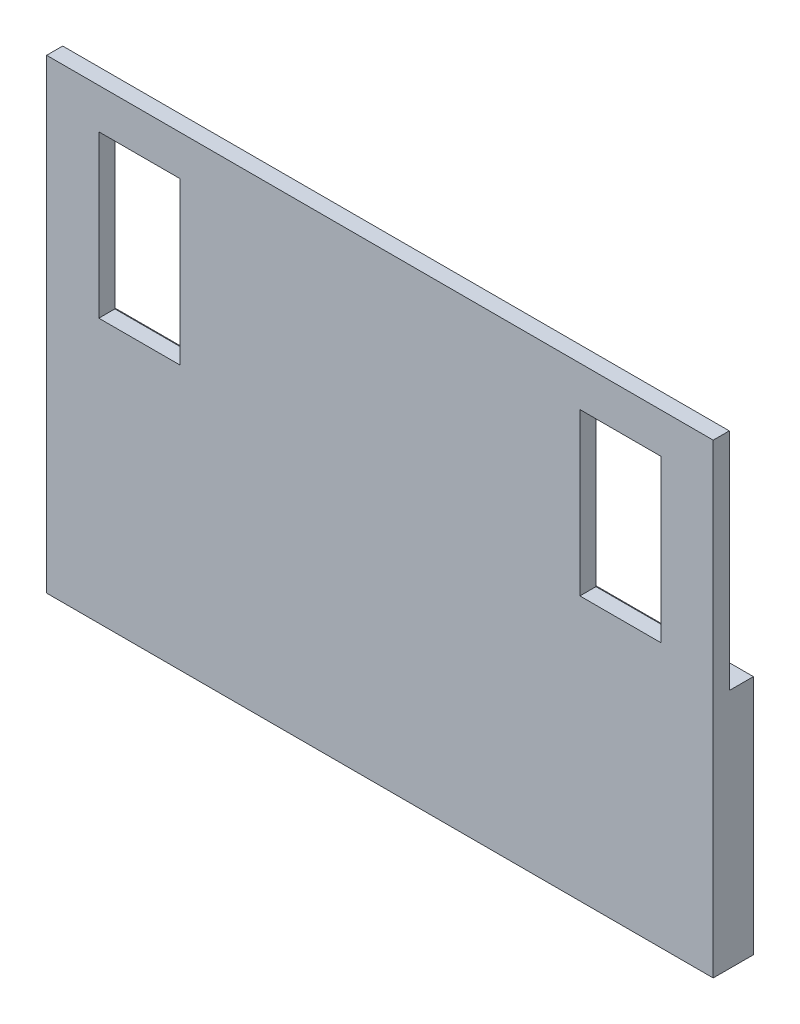
ISO-10303-21;
HEADER;
FILE_DESCRIPTION(('STEP AP214'),'2;1');
FILE_NAME('part.step','',(''),(''),'','','');
FILE_SCHEMA(('AUTOMOTIVE_DESIGN { 1 0 10303 214 1 1 1 1 }'));
ENDSEC;
DATA;
#1=APPLICATION_CONTEXT('core data for automotive mechanical design processes');
#2=APPLICATION_PROTOCOL_DEFINITION('international standard','automotive_design',2000,#1);
#3=PRODUCT_CONTEXT('',#1,'mechanical');
#4=PRODUCT('Part','Part','',(#3));
#5=PRODUCT_RELATED_PRODUCT_CATEGORY('part','',(#4));
#6=PRODUCT_DEFINITION_FORMATION('','',#4);
#7=PRODUCT_DEFINITION_CONTEXT('part definition',#1,'design');
#8=PRODUCT_DEFINITION('design','',#6,#7);
#9=PRODUCT_DEFINITION_SHAPE('','',#8);
#10=(LENGTH_UNIT() NAMED_UNIT(*) SI_UNIT(.MILLI.,.METRE.));
#11=(NAMED_UNIT(*) PLANE_ANGLE_UNIT() SI_UNIT($,.RADIAN.));
#12=(NAMED_UNIT(*) SI_UNIT($,.STERADIAN.) SOLID_ANGLE_UNIT());
#13=UNCERTAINTY_MEASURE_WITH_UNIT(LENGTH_MEASURE(1.E-05),#10,'distance_accuracy_value','');
#14=(GEOMETRIC_REPRESENTATION_CONTEXT(3) GLOBAL_UNCERTAINTY_ASSIGNED_CONTEXT((#13)) GLOBAL_UNIT_ASSIGNED_CONTEXT((#10,
#11,#12)) REPRESENTATION_CONTEXT('',''));
#15=CARTESIAN_POINT('',(0.,0.,0.));
#16=DIRECTION('',(0.,0.,1.));
#17=DIRECTION('',(1.,0.,0.));
#18=AXIS2_PLACEMENT_3D('',#15,#16,#17);
#19=CARTESIAN_POINT('',(0.,0.,0.));
#20=DIRECTION('',(0.,0.,1.));
#21=DIRECTION('',(1.,0.,0.));
#22=AXIS2_PLACEMENT_3D('',#19,#20,#21);
#23=PLANE('',#22);
#24=DIRECTION('',(0.,1.,0.));
#25=VECTOR('',#24,1.);
#26=CARTESIAN_POINT('',(-51.0499807322764,-25.3306901583921,0.));
#27=LINE('',#26,#25);
#28=CARTESIAN_POINT('',(-51.0499807322764,-45.4306901583921,0.));
#29=VERTEX_POINT('',#28);
#30=CARTESIAN_POINT('',(-51.0499807322764,-25.3306901583921,0.));
#31=VERTEX_POINT('',#30);
#32=EDGE_CURVE('E187',#29,#31,#27,.T.);
#33=ORIENTED_EDGE('',*,*,#32,.T.);
#34=DIRECTION('',(-1.,0.,0.));
#35=VECTOR('',#34,1.);
#36=CARTESIAN_POINT('',(-51.0499807322764,-25.3306901583921,0.));
#37=LINE('',#36,#35);
#38=CARTESIAN_POINT('',(-61.1499807322764,-25.3306901583921,0.));
#39=VERTEX_POINT('',#38);
#40=EDGE_CURVE('E205',#31,#39,#37,.T.);
#41=ORIENTED_EDGE('',*,*,#40,.T.);
#42=DIRECTION('',(0.,-1.,0.));
#43=VECTOR('',#42,1.);
#44=CARTESIAN_POINT('',(-61.1499807322764,-25.3306901583921,0.));
#45=LINE('',#44,#43);
#46=CARTESIAN_POINT('',(-61.1499807322764,-45.4306901583921,0.));
#47=VERTEX_POINT('',#46);
#48=EDGE_CURVE('E209',#39,#47,#45,.T.);
#49=ORIENTED_EDGE('',*,*,#48,.T.);
#50=DIRECTION('',(1.,0.,0.));
#51=VECTOR('',#50,1.);
#52=CARTESIAN_POINT('',(-51.0499807322764,-45.4306901583921,0.));
#53=LINE('',#52,#51);
#54=EDGE_CURVE('E192',#47,#29,#53,.T.);
#55=ORIENTED_EDGE('',*,*,#54,.T.);
#56=EDGE_LOOP('',(#33,#41,#49,#55));
#57=FACE_BOUND('',#56,.T.);
#58=DIRECTION('',(0.,-1.,0.));
#59=VECTOR('',#58,1.);
#60=CARTESIAN_POINT('',(-1.24998073227636,-25.3306901583921,0.));
#61=LINE('',#60,#59);
#62=CARTESIAN_POINT('',(-1.24998073227636,-25.3306901583921,0.));
#63=VERTEX_POINT('',#62);
#64=CARTESIAN_POINT('',(-1.24998073227637,-45.4306901583921,0.));
#65=VERTEX_POINT('',#64);
#66=EDGE_CURVE('E228',#63,#65,#61,.T.);
#67=ORIENTED_EDGE('',*,*,#66,.T.);
#68=DIRECTION('',(1.,0.,0.));
#69=VECTOR('',#68,1.);
#70=CARTESIAN_POINT('',(-1.24998073227637,-45.4306901583921,0.));
#71=LINE('',#70,#69);
#72=CARTESIAN_POINT('',(8.85001926772364,-45.4306901583921,0.));
#73=VERTEX_POINT('',#72);
#74=EDGE_CURVE('E247',#65,#73,#71,.T.);
#75=ORIENTED_EDGE('',*,*,#74,.T.);
#76=DIRECTION('',(0.,1.,0.));
#77=VECTOR('',#76,1.);
#78=CARTESIAN_POINT('',(8.85001926772364,-25.3306901583921,0.));
#79=LINE('',#78,#77);
#80=CARTESIAN_POINT('',(8.85001926772364,-25.3306901583921,0.));
#81=VERTEX_POINT('',#80);
#82=EDGE_CURVE('E251',#73,#81,#79,.T.);
#83=ORIENTED_EDGE('',*,*,#82,.T.);
#84=DIRECTION('',(-1.,0.,0.));
#85=VECTOR('',#84,1.);
#86=CARTESIAN_POINT('',(-1.24998073227636,-25.3306901583921,0.));
#87=LINE('',#86,#85);
#88=EDGE_CURVE('E233',#81,#63,#87,.T.);
#89=ORIENTED_EDGE('',*,*,#88,.T.);
#90=EDGE_LOOP('',(#67,#75,#83,#89));
#91=FACE_BOUND('',#90,.T.);
#92=DIRECTION('',(1.,0.,0.));
#93=VECTOR('',#92,1.);
#94=CARTESIAN_POINT('',(15.3500192677236,-48.3306901583921,0.));
#95=LINE('',#94,#93);
#96=CARTESIAN_POINT('',(-67.6499807322764,-48.3306901583921,0.));
#97=VERTEX_POINT('',#96);
#98=CARTESIAN_POINT('',(15.3500192677236,-48.3306901583921,0.));
#99=VERTEX_POINT('',#98);
#100=EDGE_CURVE('E61',#97,#99,#95,.T.);
#101=ORIENTED_EDGE('',*,*,#100,.F.);
#102=DIRECTION('',(0.,-1.,0.));
#103=VECTOR('',#102,1.);
#104=CARTESIAN_POINT('',(-67.6499807322764,-20.3306901583921,0.));
#105=LINE('',#104,#103);
#106=CARTESIAN_POINT('',(-67.6499807322764,-20.3306901583921,0.));
#107=VERTEX_POINT('',#106);
#108=EDGE_CURVE('E271',#107,#97,#105,.T.);
#109=ORIENTED_EDGE('',*,*,#108,.F.);
#110=DIRECTION('',(-1.,0.,0.));
#111=VECTOR('',#110,1.);
#112=CARTESIAN_POINT('',(-67.6499807322764,-20.3306901583921,0.));
#113=LINE('',#112,#111);
#114=CARTESIAN_POINT('',(15.3500192677236,-20.3306901583921,0.));
#115=VERTEX_POINT('',#114);
#116=EDGE_CURVE('E277',#115,#107,#113,.T.);
#117=ORIENTED_EDGE('',*,*,#116,.F.);
#118=DIRECTION('',(0.,1.,0.));
#119=VECTOR('',#118,1.);
#120=CARTESIAN_POINT('',(15.3500192677236,-20.3306901583921,0.));
#121=LINE('',#120,#119);
#122=EDGE_CURVE('E288',#99,#115,#121,.T.);
#123=ORIENTED_EDGE('',*,*,#122,.F.);
#124=EDGE_LOOP('',(#101,#109,#117,#123));
#125=FACE_BOUND('',#124,.T.);
#126=ADVANCED_FACE('F45',(#57,#91,#125),#23,.F.);
#127=CARTESIAN_POINT('',(0.,0.,2.));
#128=DIRECTION('',(0.,0.,1.));
#129=DIRECTION('',(1.,0.,0.));
#130=AXIS2_PLACEMENT_3D('',#127,#128,#129);
#131=PLANE('',#130);
#132=DIRECTION('',(0.,-1.,0.));
#133=VECTOR('',#132,1.);
#134=CARTESIAN_POINT('',(-67.6499807322764,-20.3306901583921,2.));
#135=LINE('',#134,#133);
#136=CARTESIAN_POINT('',(-67.6499807322764,-20.3306901583921,2.));
#137=VERTEX_POINT('',#136);
#138=CARTESIAN_POINT('',(-67.6499807322764,-78.3306901583921,2.));
#139=VERTEX_POINT('',#138);
#140=EDGE_CURVE('E272',#137,#139,#135,.T.);
#141=ORIENTED_EDGE('',*,*,#140,.T.);
#142=DIRECTION('',(1.,0.,0.));
#143=VECTOR('',#142,1.);
#144=CARTESIAN_POINT('',(-67.6499807322764,-78.3306901583921,2.));
#145=LINE('',#144,#143);
#146=CARTESIAN_POINT('',(15.3500192677236,-78.3306901583921,2.));
#147=VERTEX_POINT('',#146);
#148=EDGE_CURVE('E276',#139,#147,#145,.T.);
#149=ORIENTED_EDGE('',*,*,#148,.T.);
#150=DIRECTION('',(0.,1.,0.));
#151=VECTOR('',#150,1.);
#152=CARTESIAN_POINT('',(15.3500192677236,-20.3306901583921,2.));
#153=LINE('',#152,#151);
#154=CARTESIAN_POINT('',(15.3500192677236,-20.3306901583921,2.));
#155=VERTEX_POINT('',#154);
#156=EDGE_CURVE('E154',#147,#155,#153,.T.);
#157=ORIENTED_EDGE('',*,*,#156,.T.);
#158=DIRECTION('',(-1.,0.,0.));
#159=VECTOR('',#158,1.);
#160=CARTESIAN_POINT('',(-67.6499807322764,-20.3306901583921,2.));
#161=LINE('',#160,#159);
#162=EDGE_CURVE('E282',#155,#137,#161,.T.);
#163=ORIENTED_EDGE('',*,*,#162,.T.);
#164=EDGE_LOOP('',(#141,#149,#157,#163));
#165=FACE_BOUND('',#164,.T.);
#166=DIRECTION('',(1.,0.,0.));
#167=VECTOR('',#166,1.);
#168=CARTESIAN_POINT('',(-1.24998073227637,-45.4306901583921,2.));
#169=LINE('',#168,#167);
#170=CARTESIAN_POINT('',(-1.24998073227637,-45.4306901583921,2.));
#171=VERTEX_POINT('',#170);
#172=CARTESIAN_POINT('',(8.85001926772364,-45.4306901583921,2.));
#173=VERTEX_POINT('',#172);
#174=EDGE_CURVE('E232',#171,#173,#169,.T.);
#175=ORIENTED_EDGE('',*,*,#174,.F.);
#176=DIRECTION('',(0.,-1.,0.));
#177=VECTOR('',#176,1.);
#178=CARTESIAN_POINT('',(-1.24998073227636,-25.3306901583921,2.));
#179=LINE('',#178,#177);
#180=CARTESIAN_POINT('',(-1.24998073227636,-25.3306901583921,2.));
#181=VERTEX_POINT('',#180);
#182=EDGE_CURVE('E229',#181,#171,#179,.T.);
#183=ORIENTED_EDGE('',*,*,#182,.F.);
#184=DIRECTION('',(-1.,0.,0.));
#185=VECTOR('',#184,1.);
#186=CARTESIAN_POINT('',(-1.24998073227636,-25.3306901583921,2.));
#187=LINE('',#186,#185);
#188=CARTESIAN_POINT('',(8.85001926772364,-25.3306901583921,2.));
#189=VERTEX_POINT('',#188);
#190=EDGE_CURVE('E240',#189,#181,#187,.T.);
#191=ORIENTED_EDGE('',*,*,#190,.F.);
#192=DIRECTION('',(0.,1.,0.));
#193=VECTOR('',#192,1.);
#194=CARTESIAN_POINT('',(8.85001926772364,-25.3306901583921,2.));
#195=LINE('',#194,#193);
#196=EDGE_CURVE('E236',#173,#189,#195,.T.);
#197=ORIENTED_EDGE('',*,*,#196,.F.);
#198=EDGE_LOOP('',(#175,#183,#191,#197));
#199=FACE_BOUND('',#198,.T.);
#200=DIRECTION('',(-1.,0.,0.));
#201=VECTOR('',#200,1.);
#202=CARTESIAN_POINT('',(-51.0499807322764,-25.3306901583921,2.));
#203=LINE('',#202,#201);
#204=CARTESIAN_POINT('',(-51.0499807322764,-25.3306901583921,2.));
#205=VERTEX_POINT('',#204);
#206=CARTESIAN_POINT('',(-61.1499807322764,-25.3306901583921,2.));
#207=VERTEX_POINT('',#206);
#208=EDGE_CURVE('E191',#205,#207,#203,.T.);
#209=ORIENTED_EDGE('',*,*,#208,.F.);
#210=DIRECTION('',(0.,1.,0.));
#211=VECTOR('',#210,1.);
#212=CARTESIAN_POINT('',(-51.0499807322764,-25.3306901583921,2.));
#213=LINE('',#212,#211);
#214=CARTESIAN_POINT('',(-51.0499807322764,-45.4306901583921,2.));
#215=VERTEX_POINT('',#214);
#216=EDGE_CURVE('E188',#215,#205,#213,.T.);
#217=ORIENTED_EDGE('',*,*,#216,.F.);
#218=DIRECTION('',(1.,0.,0.));
#219=VECTOR('',#218,1.);
#220=CARTESIAN_POINT('',(-51.0499807322764,-45.4306901583921,2.));
#221=LINE('',#220,#219);
#222=CARTESIAN_POINT('',(-61.1499807322764,-45.4306901583921,2.));
#223=VERTEX_POINT('',#222);
#224=EDGE_CURVE('E198',#223,#215,#221,.T.);
#225=ORIENTED_EDGE('',*,*,#224,.F.);
#226=DIRECTION('',(0.,-1.,0.));
#227=VECTOR('',#226,1.);
#228=CARTESIAN_POINT('',(-61.1499807322764,-25.3306901583921,2.));
#229=LINE('',#228,#227);
#230=EDGE_CURVE('E195',#207,#223,#229,.T.);
#231=ORIENTED_EDGE('',*,*,#230,.F.);
#232=EDGE_LOOP('',(#209,#217,#225,#231));
#233=FACE_BOUND('',#232,.T.);
#234=ADVANCED_FACE('F320',(#165,#199,#233),#131,.T.);
#235=CARTESIAN_POINT('',(-67.6499807322764,-20.3306901583921,2.));
#236=DIRECTION('',(1.,0.,0.));
#237=DIRECTION('',(0.,0.,-1.));
#238=AXIS2_PLACEMENT_3D('',#235,#236,#237);
#239=PLANE('',#238);
#240=ORIENTED_EDGE('',*,*,#108,.T.);
#241=DIRECTION('',(0.,0.,1.));
#242=VECTOR('',#241,1.);
#243=CARTESIAN_POINT('',(-67.6499807322764,-48.3306901583921,-3.));
#244=LINE('',#243,#242);
#245=CARTESIAN_POINT('',(-67.6499807322764,-48.3306901583921,-3.));
#246=VERTEX_POINT('',#245);
#247=EDGE_CURVE('E183',#246,#97,#244,.T.);
#248=ORIENTED_EDGE('',*,*,#247,.F.);
#249=DIRECTION('',(0.,1.,0.));
#250=VECTOR('',#249,1.);
#251=CARTESIAN_POINT('',(-67.6499807322764,-48.3306901583921,-3.));
#252=LINE('',#251,#250);
#253=CARTESIAN_POINT('',(-67.6499807322764,-78.3306901583921,-3.));
#254=VERTEX_POINT('',#253);
#255=EDGE_CURVE('E165',#254,#246,#252,.T.);
#256=ORIENTED_EDGE('',*,*,#255,.F.);
#257=DIRECTION('',(0.,0.,-1.));
#258=VECTOR('',#257,1.);
#259=CARTESIAN_POINT('',(-67.6499807322764,-78.3306901583921,2.));
#260=LINE('',#259,#258);
#261=EDGE_CURVE('E11',#139,#254,#260,.T.);
#262=ORIENTED_EDGE('',*,*,#261,.F.);
#263=ORIENTED_EDGE('',*,*,#140,.F.);
#264=DIRECTION('',(0.,0.,-1.));
#265=VECTOR('',#264,1.);
#266=CARTESIAN_POINT('',(-67.6499807322764,-20.3306901583921,2.));
#267=LINE('',#266,#265);
#268=EDGE_CURVE('E285',#137,#107,#267,.T.);
#269=ORIENTED_EDGE('',*,*,#268,.T.);
#270=EDGE_LOOP('',(#240,#248,#256,#262,#263,#269));
#271=FACE_BOUND('',#270,.T.);
#272=ADVANCED_FACE('F47',(#271),#239,.F.);
#273=CARTESIAN_POINT('',(-67.6499807322764,-78.3306901583921,2.));
#274=DIRECTION('',(0.,1.,0.));
#275=DIRECTION('',(0.,0.,1.));
#276=AXIS2_PLACEMENT_3D('',#273,#274,#275);
#277=PLANE('',#276);
#278=ORIENTED_EDGE('',*,*,#261,.T.);
#279=DIRECTION('',(-1.,0.,0.));
#280=VECTOR('',#279,1.);
#281=CARTESIAN_POINT('',(15.3500192677236,-78.3306901583921,-3.));
#282=LINE('',#281,#280);
#283=CARTESIAN_POINT('',(15.3500192677236,-78.3306901583921,-3.));
#284=VERTEX_POINT('',#283);
#285=EDGE_CURVE('E159',#284,#254,#282,.T.);
#286=ORIENTED_EDGE('',*,*,#285,.F.);
#287=DIRECTION('',(0.,0.,-1.));
#288=VECTOR('',#287,1.);
#289=CARTESIAN_POINT('',(15.3500192677236,-78.3306901583921,2.));
#290=LINE('',#289,#288);
#291=EDGE_CURVE('E54',#147,#284,#290,.T.);
#292=ORIENTED_EDGE('',*,*,#291,.F.);
#293=ORIENTED_EDGE('',*,*,#148,.F.);
#294=EDGE_LOOP('',(#278,#286,#292,#293));
#295=FACE_BOUND('',#294,.T.);
#296=ADVANCED_FACE('F160',(#295),#277,.F.);
#297=CARTESIAN_POINT('',(15.3500192677236,-20.3306901583921,2.));
#298=DIRECTION('',(-1.,0.,0.));
#299=DIRECTION('',(0.,-1.,0.));
#300=AXIS2_PLACEMENT_3D('',#297,#298,#299);
#301=PLANE('',#300);
#302=ORIENTED_EDGE('',*,*,#291,.T.);
#303=DIRECTION('',(0.,-1.,0.));
#304=VECTOR('',#303,1.);
#305=CARTESIAN_POINT('',(15.3500192677236,-48.3306901583921,-3.));
#306=LINE('',#305,#304);
#307=CARTESIAN_POINT('',(15.3500192677236,-48.3306901583921,-3.));
#308=VERTEX_POINT('',#307);
#309=EDGE_CURVE('E152',#308,#284,#306,.T.);
#310=ORIENTED_EDGE('',*,*,#309,.F.);
#311=DIRECTION('',(0.,0.,1.));
#312=VECTOR('',#311,1.);
#313=CARTESIAN_POINT('',(15.3500192677236,-48.3306901583921,-3.));
#314=LINE('',#313,#312);
#315=EDGE_CURVE('E179',#308,#99,#314,.T.);
#316=ORIENTED_EDGE('',*,*,#315,.T.);
#317=ORIENTED_EDGE('',*,*,#122,.T.);
#318=DIRECTION('',(0.,0.,-1.));
#319=VECTOR('',#318,1.);
#320=CARTESIAN_POINT('',(15.3500192677236,-20.3306901583921,2.));
#321=LINE('',#320,#319);
#322=EDGE_CURVE('E157',#155,#115,#321,.T.);
#323=ORIENTED_EDGE('',*,*,#322,.F.);
#324=ORIENTED_EDGE('',*,*,#156,.F.);
#325=EDGE_LOOP('',(#302,#310,#316,#317,#323,#324));
#326=FACE_BOUND('',#325,.T.);
#327=ADVANCED_FACE('F149',(#326),#301,.F.);
#328=CARTESIAN_POINT('',(-67.6499807322764,-20.3306901583921,2.));
#329=DIRECTION('',(0.,-1.,0.));
#330=DIRECTION('',(0.,0.,-1.));
#331=AXIS2_PLACEMENT_3D('',#328,#329,#330);
#332=PLANE('',#331);
#333=ORIENTED_EDGE('',*,*,#116,.T.);
#334=ORIENTED_EDGE('',*,*,#268,.F.);
#335=ORIENTED_EDGE('',*,*,#162,.F.);
#336=ORIENTED_EDGE('',*,*,#322,.T.);
#337=EDGE_LOOP('',(#333,#334,#335,#336));
#338=FACE_BOUND('',#337,.T.);
#339=ADVANCED_FACE('F301',(#338),#332,.F.);
#340=CARTESIAN_POINT('',(-1.24998073227636,-25.3306901583921,2.));
#341=DIRECTION('',(1.,0.,0.));
#342=DIRECTION('',(0.,1.,0.));
#343=AXIS2_PLACEMENT_3D('',#340,#341,#342);
#344=PLANE('',#343);
#345=ORIENTED_EDGE('',*,*,#66,.F.);
#346=DIRECTION('',(0.,0.,-1.));
#347=VECTOR('',#346,1.);
#348=CARTESIAN_POINT('',(-1.24998073227636,-25.3306901583921,2.));
#349=LINE('',#348,#347);
#350=EDGE_CURVE('E243',#181,#63,#349,.T.);
#351=ORIENTED_EDGE('',*,*,#350,.F.);
#352=ORIENTED_EDGE('',*,*,#182,.T.);
#353=DIRECTION('',(0.,0.,-1.));
#354=VECTOR('',#353,1.);
#355=CARTESIAN_POINT('',(-1.24998073227637,-45.4306901583921,2.));
#356=LINE('',#355,#354);
#357=EDGE_CURVE('E267',#171,#65,#356,.T.);
#358=ORIENTED_EDGE('',*,*,#357,.T.);
#359=EDGE_LOOP('',(#345,#351,#352,#358));
#360=FACE_BOUND('',#359,.T.);
#361=ADVANCED_FACE('F334',(#360),#344,.T.);
#362=CARTESIAN_POINT('',(-1.24998073227637,-45.4306901583921,2.));
#363=DIRECTION('',(0.,1.,0.));
#364=DIRECTION('',(0.,0.,1.));
#365=AXIS2_PLACEMENT_3D('',#362,#363,#364);
#366=PLANE('',#365);
#367=ORIENTED_EDGE('',*,*,#74,.F.);
#368=ORIENTED_EDGE('',*,*,#357,.F.);
#369=ORIENTED_EDGE('',*,*,#174,.T.);
#370=DIRECTION('',(0.,0.,-1.));
#371=VECTOR('',#370,1.);
#372=CARTESIAN_POINT('',(8.85001926772364,-45.4306901583921,2.));
#373=LINE('',#372,#371);
#374=EDGE_CURVE('E264',#173,#73,#373,.T.);
#375=ORIENTED_EDGE('',*,*,#374,.T.);
#376=EDGE_LOOP('',(#367,#368,#369,#375));
#377=FACE_BOUND('',#376,.T.);
#378=ADVANCED_FACE('F422',(#377),#366,.T.);
#379=CARTESIAN_POINT('',(8.85001926772364,-25.3306901583921,2.));
#380=DIRECTION('',(-1.,0.,0.));
#381=DIRECTION('',(0.,-1.,0.));
#382=AXIS2_PLACEMENT_3D('',#379,#380,#381);
#383=PLANE('',#382);
#384=ORIENTED_EDGE('',*,*,#82,.F.);
#385=ORIENTED_EDGE('',*,*,#374,.F.);
#386=ORIENTED_EDGE('',*,*,#196,.T.);
#387=DIRECTION('',(0.,0.,-1.));
#388=VECTOR('',#387,1.);
#389=CARTESIAN_POINT('',(8.85001926772364,-25.3306901583921,2.));
#390=LINE('',#389,#388);
#391=EDGE_CURVE('E261',#189,#81,#390,.T.);
#392=ORIENTED_EDGE('',*,*,#391,.T.);
#393=EDGE_LOOP('',(#384,#385,#386,#392));
#394=FACE_BOUND('',#393,.T.);
#395=ADVANCED_FACE('F413',(#394),#383,.T.);
#396=CARTESIAN_POINT('',(-1.24998073227636,-25.3306901583921,2.));
#397=DIRECTION('',(0.,-1.,0.));
#398=DIRECTION('',(0.,0.,-1.));
#399=AXIS2_PLACEMENT_3D('',#396,#397,#398);
#400=PLANE('',#399);
#401=ORIENTED_EDGE('',*,*,#88,.F.);
#402=ORIENTED_EDGE('',*,*,#391,.F.);
#403=ORIENTED_EDGE('',*,*,#190,.T.);
#404=ORIENTED_EDGE('',*,*,#350,.T.);
#405=EDGE_LOOP('',(#401,#402,#403,#404));
#406=FACE_BOUND('',#405,.T.);
#407=ADVANCED_FACE('F404',(#406),#400,.T.);
#408=CARTESIAN_POINT('',(-51.0499807322764,-25.3306901583921,2.));
#409=DIRECTION('',(-1.,0.,0.));
#410=DIRECTION('',(0.,-1.,0.));
#411=AXIS2_PLACEMENT_3D('',#408,#409,#410);
#412=PLANE('',#411);
#413=ORIENTED_EDGE('',*,*,#32,.F.);
#414=DIRECTION('',(0.,0.,-1.));
#415=VECTOR('',#414,1.);
#416=CARTESIAN_POINT('',(-51.0499807322764,-45.4306901583921,2.));
#417=LINE('',#416,#415);
#418=EDGE_CURVE('E201',#215,#29,#417,.T.);
#419=ORIENTED_EDGE('',*,*,#418,.F.);
#420=ORIENTED_EDGE('',*,*,#216,.T.);
#421=DIRECTION('',(0.,0.,-1.));
#422=VECTOR('',#421,1.);
#423=CARTESIAN_POINT('',(-51.0499807322764,-25.3306901583921,2.));
#424=LINE('',#423,#422);
#425=EDGE_CURVE('E224',#205,#31,#424,.T.);
#426=ORIENTED_EDGE('',*,*,#425,.T.);
#427=EDGE_LOOP('',(#413,#419,#420,#426));
#428=FACE_BOUND('',#427,.T.);
#429=ADVANCED_FACE('F395',(#428),#412,.T.);
#430=CARTESIAN_POINT('',(-51.0499807322764,-25.3306901583921,2.));
#431=DIRECTION('',(0.,-1.,0.));
#432=DIRECTION('',(0.,0.,-1.));
#433=AXIS2_PLACEMENT_3D('',#430,#431,#432);
#434=PLANE('',#433);
#435=ORIENTED_EDGE('',*,*,#40,.F.);
#436=ORIENTED_EDGE('',*,*,#425,.F.);
#437=ORIENTED_EDGE('',*,*,#208,.T.);
#438=DIRECTION('',(0.,0.,-1.));
#439=VECTOR('',#438,1.);
#440=CARTESIAN_POINT('',(-61.1499807322764,-25.3306901583921,2.));
#441=LINE('',#440,#439);
#442=EDGE_CURVE('E221',#207,#39,#441,.T.);
#443=ORIENTED_EDGE('',*,*,#442,.T.);
#444=EDGE_LOOP('',(#435,#436,#437,#443));
#445=FACE_BOUND('',#444,.T.);
#446=ADVANCED_FACE('F386',(#445),#434,.T.);
#447=CARTESIAN_POINT('',(-61.1499807322764,-25.3306901583921,2.));
#448=DIRECTION('',(1.,0.,0.));
#449=DIRECTION('',(0.,0.,-1.));
#450=AXIS2_PLACEMENT_3D('',#447,#448,#449);
#451=PLANE('',#450);
#452=ORIENTED_EDGE('',*,*,#48,.F.);
#453=ORIENTED_EDGE('',*,*,#442,.F.);
#454=ORIENTED_EDGE('',*,*,#230,.T.);
#455=DIRECTION('',(0.,0.,-1.));
#456=VECTOR('',#455,1.);
#457=CARTESIAN_POINT('',(-61.1499807322764,-45.4306901583921,2.));
#458=LINE('',#457,#456);
#459=EDGE_CURVE('E69',#223,#47,#458,.T.);
#460=ORIENTED_EDGE('',*,*,#459,.T.);
#461=EDGE_LOOP('',(#452,#453,#454,#460));
#462=FACE_BOUND('',#461,.T.);
#463=ADVANCED_FACE('F317',(#462),#451,.T.);
#464=CARTESIAN_POINT('',(-51.0499807322764,-45.4306901583921,2.));
#465=DIRECTION('',(0.,1.,0.));
#466=DIRECTION('',(0.,0.,1.));
#467=AXIS2_PLACEMENT_3D('',#464,#465,#466);
#468=PLANE('',#467);
#469=ORIENTED_EDGE('',*,*,#54,.F.);
#470=ORIENTED_EDGE('',*,*,#459,.F.);
#471=ORIENTED_EDGE('',*,*,#224,.T.);
#472=ORIENTED_EDGE('',*,*,#418,.T.);
#473=EDGE_LOOP('',(#469,#470,#471,#472));
#474=FACE_BOUND('',#473,.T.);
#475=ADVANCED_FACE('F309',(#474),#468,.T.);
#476=CARTESIAN_POINT('',(15.3500192677236,-48.3306901583921,-3.));
#477=DIRECTION('',(0.,-1.,0.));
#478=DIRECTION('',(0.,0.,-1.));
#479=AXIS2_PLACEMENT_3D('',#476,#477,#478);
#480=PLANE('',#479);
#481=ORIENTED_EDGE('',*,*,#100,.T.);
#482=ORIENTED_EDGE('',*,*,#315,.F.);
#483=DIRECTION('',(1.,0.,0.));
#484=VECTOR('',#483,1.);
#485=CARTESIAN_POINT('',(15.3500192677236,-48.3306901583921,-3.));
#486=LINE('',#485,#484);
#487=EDGE_CURVE('E169',#246,#308,#486,.T.);
#488=ORIENTED_EDGE('',*,*,#487,.F.);
#489=ORIENTED_EDGE('',*,*,#247,.T.);
#490=EDGE_LOOP('',(#481,#482,#488,#489));
#491=FACE_BOUND('',#490,.T.);
#492=ADVANCED_FACE('F307',(#491),#480,.F.);
#493=CARTESIAN_POINT('',(0.,0.,-3.));
#494=DIRECTION('',(0.,0.,-1.));
#495=DIRECTION('',(-1.,0.,0.));
#496=AXIS2_PLACEMENT_3D('',#493,#494,#495);
#497=PLANE('',#496);
#498=ORIENTED_EDGE('',*,*,#309,.T.);
#499=ORIENTED_EDGE('',*,*,#285,.T.);
#500=ORIENTED_EDGE('',*,*,#255,.T.);
#501=ORIENTED_EDGE('',*,*,#487,.T.);
#502=EDGE_LOOP('',(#498,#499,#500,#501));
#503=FACE_BOUND('',#502,.T.);
#504=ADVANCED_FACE('F167',(#503),#497,.T.);
#505=CLOSED_SHELL('',(#126,#234,#272,#296,#327,#339,#361,#378,#395,#407,#429,#446,#463,#475,
#492,#504));
#506=MANIFOLD_SOLID_BREP('B2',#505);
#507=ADVANCED_BREP_SHAPE_REPRESENTATION('',(#18,#506),#14);
#508=SHAPE_DEFINITION_REPRESENTATION(#9,#507);
ENDSEC;
END-ISO-10303-21;
